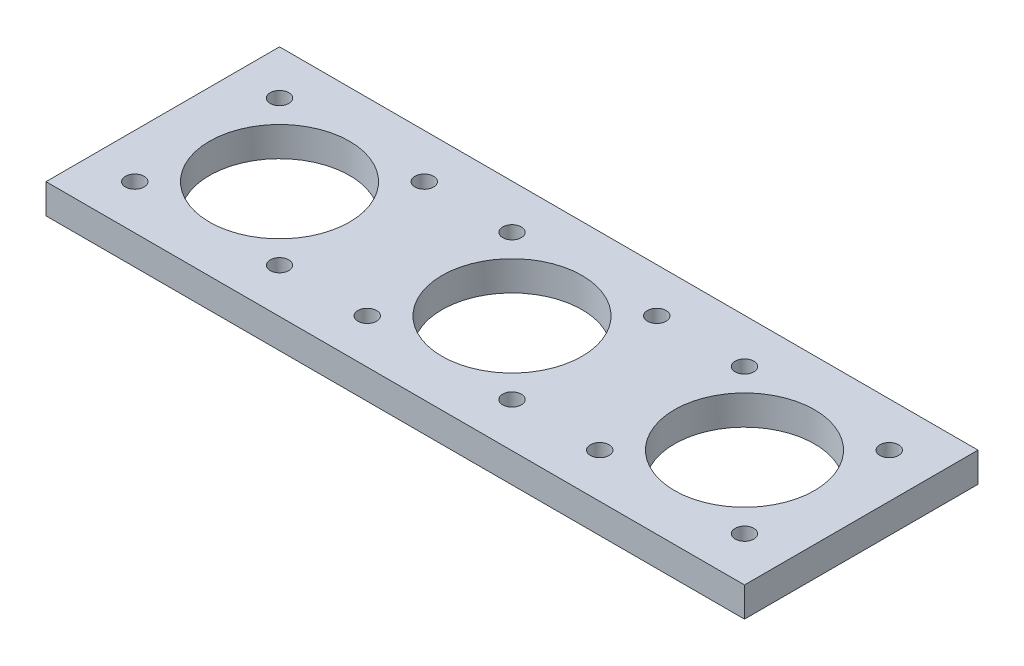
ISO-10303-21;
HEADER;
FILE_DESCRIPTION(('STEP AP214'),'2;1');
FILE_NAME('part.step','',(''),(''),'','','');
FILE_SCHEMA(('AUTOMOTIVE_DESIGN { 1 0 10303 214 1 1 1 1 }'));
ENDSEC;
DATA;
#1=APPLICATION_CONTEXT('core data for automotive mechanical design processes');
#2=APPLICATION_PROTOCOL_DEFINITION('international standard','automotive_design',2000,#1);
#3=PRODUCT_CONTEXT('',#1,'mechanical');
#4=PRODUCT('Part','Part','',(#3));
#5=PRODUCT_RELATED_PRODUCT_CATEGORY('part','',(#4));
#6=PRODUCT_DEFINITION_FORMATION('','',#4);
#7=PRODUCT_DEFINITION_CONTEXT('part definition',#1,'design');
#8=PRODUCT_DEFINITION('design','',#6,#7);
#9=PRODUCT_DEFINITION_SHAPE('','',#8);
#10=(LENGTH_UNIT() NAMED_UNIT(*) SI_UNIT(.MILLI.,.METRE.));
#11=(NAMED_UNIT(*) PLANE_ANGLE_UNIT() SI_UNIT($,.RADIAN.));
#12=(NAMED_UNIT(*) SI_UNIT($,.STERADIAN.) SOLID_ANGLE_UNIT());
#13=UNCERTAINTY_MEASURE_WITH_UNIT(LENGTH_MEASURE(1.E-05),#10,'distance_accuracy_value','');
#14=(GEOMETRIC_REPRESENTATION_CONTEXT(3) GLOBAL_UNCERTAINTY_ASSIGNED_CONTEXT((#13)) GLOBAL_UNIT_ASSIGNED_CONTEXT((#10,
#11,#12)) REPRESENTATION_CONTEXT('',''));
#15=CARTESIAN_POINT('',(0.,0.,0.));
#16=DIRECTION('',(0.,0.,1.));
#17=DIRECTION('',(1.,0.,0.));
#18=AXIS2_PLACEMENT_3D('',#15,#16,#17);
#19=CARTESIAN_POINT('',(-25.,6.35,-25.));
#20=DIRECTION('',(0.,0.,1.));
#21=DIRECTION('',(1.,0.,0.));
#22=AXIS2_PLACEMENT_3D('',#19,#20,#21);
#23=PLANE('',#22);
#24=DIRECTION('',(0.,-1.,0.));
#25=VECTOR('',#24,1.);
#26=CARTESIAN_POINT('',(-25.,6.35,-25.));
#27=LINE('',#26,#25);
#28=CARTESIAN_POINT('',(-25.,6.35,-25.));
#29=VERTEX_POINT('',#28);
#30=CARTESIAN_POINT('',(-25.,0.,-25.));
#31=VERTEX_POINT('',#30);
#32=EDGE_CURVE('E11',#29,#31,#27,.T.);
#33=ORIENTED_EDGE('',*,*,#32,.F.);
#34=DIRECTION('',(-1.,0.,0.));
#35=VECTOR('',#34,1.);
#36=CARTESIAN_POINT('',(-25.,6.35,-25.));
#37=LINE('',#36,#35);
#38=CARTESIAN_POINT('',(124.568,6.35,-25.));
#39=VERTEX_POINT('',#38);
#40=EDGE_CURVE('E89',#39,#29,#37,.T.);
#41=ORIENTED_EDGE('',*,*,#40,.F.);
#42=DIRECTION('',(0.,-1.,0.));
#43=VECTOR('',#42,1.);
#44=CARTESIAN_POINT('',(124.568,6.35,-25.));
#45=LINE('',#44,#43);
#46=CARTESIAN_POINT('',(124.568,0.,-25.));
#47=VERTEX_POINT('',#46);
#48=EDGE_CURVE('E98',#39,#47,#45,.T.);
#49=ORIENTED_EDGE('',*,*,#48,.T.);
#50=DIRECTION('',(-1.,0.,0.));
#51=VECTOR('',#50,1.);
#52=CARTESIAN_POINT('',(-25.,0.,-25.));
#53=LINE('',#52,#51);
#54=EDGE_CURVE('E64',#47,#31,#53,.T.);
#55=ORIENTED_EDGE('',*,*,#54,.T.);
#56=EDGE_LOOP('',(#33,#41,#49,#55));
#57=FACE_BOUND('',#56,.T.);
#58=ADVANCED_FACE('F37',(#57),#23,.F.);
#59=CARTESIAN_POINT('',(-25.,6.35,25.));
#60=DIRECTION('',(1.,0.,0.));
#61=DIRECTION('',(0.,0.,-1.));
#62=AXIS2_PLACEMENT_3D('',#59,#60,#61);
#63=PLANE('',#62);
#64=DIRECTION('',(0.,0.,1.));
#65=VECTOR('',#64,1.);
#66=CARTESIAN_POINT('',(-25.,0.,25.));
#67=LINE('',#66,#65);
#68=CARTESIAN_POINT('',(-25.,0.,25.));
#69=VERTEX_POINT('',#68);
#70=EDGE_CURVE('E90',#31,#69,#67,.T.);
#71=ORIENTED_EDGE('',*,*,#70,.T.);
#72=DIRECTION('',(0.,-1.,0.));
#73=VECTOR('',#72,1.);
#74=CARTESIAN_POINT('',(-25.,6.35,25.));
#75=LINE('',#74,#73);
#76=CARTESIAN_POINT('',(-25.,6.35,25.));
#77=VERTEX_POINT('',#76);
#78=EDGE_CURVE('E45',#77,#69,#75,.T.);
#79=ORIENTED_EDGE('',*,*,#78,.F.);
#80=DIRECTION('',(0.,0.,1.));
#81=VECTOR('',#80,1.);
#82=CARTESIAN_POINT('',(-25.,6.35,25.));
#83=LINE('',#82,#81);
#84=EDGE_CURVE('E53',#29,#77,#83,.T.);
#85=ORIENTED_EDGE('',*,*,#84,.F.);
#86=ORIENTED_EDGE('',*,*,#32,.T.);
#87=EDGE_LOOP('',(#71,#79,#85,#86));
#88=FACE_BOUND('',#87,.T.);
#89=ADVANCED_FACE('F175',(#88),#63,.F.);
#90=CARTESIAN_POINT('',(-25.,6.35,25.));
#91=DIRECTION('',(0.,0.,-1.));
#92=DIRECTION('',(-1.,0.,0.));
#93=AXIS2_PLACEMENT_3D('',#90,#91,#92);
#94=PLANE('',#93);
#95=DIRECTION('',(0.,-1.,0.));
#96=VECTOR('',#95,1.);
#97=CARTESIAN_POINT('',(124.568,6.35,25.));
#98=LINE('',#97,#96);
#99=CARTESIAN_POINT('',(124.568,6.35,25.));
#100=VERTEX_POINT('',#99);
#101=CARTESIAN_POINT('',(124.568,0.,25.));
#102=VERTEX_POINT('',#101);
#103=EDGE_CURVE('E84',#100,#102,#98,.T.);
#104=ORIENTED_EDGE('',*,*,#103,.F.);
#105=DIRECTION('',(1.,0.,0.));
#106=VECTOR('',#105,1.);
#107=CARTESIAN_POINT('',(-25.,6.35,25.));
#108=LINE('',#107,#106);
#109=EDGE_CURVE('E70',#77,#100,#108,.T.);
#110=ORIENTED_EDGE('',*,*,#109,.F.);
#111=ORIENTED_EDGE('',*,*,#78,.T.);
#112=DIRECTION('',(1.,0.,0.));
#113=VECTOR('',#112,1.);
#114=CARTESIAN_POINT('',(-25.,0.,25.));
#115=LINE('',#114,#113);
#116=EDGE_CURVE('E81',#69,#102,#115,.T.);
#117=ORIENTED_EDGE('',*,*,#116,.T.);
#118=EDGE_LOOP('',(#104,#110,#111,#117));
#119=FACE_BOUND('',#118,.T.);
#120=ADVANCED_FACE('F83',(#119),#94,.F.);
#121=CARTESIAN_POINT('',(0.,6.35,0.));
#122=DIRECTION('',(0.,-1.,0.));
#123=DIRECTION('',(0.,0.,-1.));
#124=AXIS2_PLACEMENT_3D('',#121,#122,#123);
#125=PLANE('',#124);
#126=ORIENTED_EDGE('',*,*,#40,.T.);
#127=ORIENTED_EDGE('',*,*,#84,.T.);
#128=ORIENTED_EDGE('',*,*,#109,.T.);
#129=DIRECTION('',(0.,0.,-1.));
#130=VECTOR('',#129,1.);
#131=CARTESIAN_POINT('',(124.568,6.35,25.));
#132=LINE('',#131,#130);
#133=EDGE_CURVE('E97',#100,#39,#132,.T.);
#134=ORIENTED_EDGE('',*,*,#133,.T.);
#135=EDGE_LOOP('',(#126,#127,#128,#134));
#136=FACE_BOUND('',#135,.T.);
#137=CARTESIAN_POINT('',(0.,6.35,0.));
#138=DIRECTION('',(0.,-1.,0.));
#139=DIRECTION('',(0.,0.,-1.));
#140=AXIS2_PLACEMENT_3D('',#137,#138,#139);
#141=CIRCLE('',#140,15.);
#142=CARTESIAN_POINT('',(0.,6.35,-15.));
#143=VERTEX_POINT('',#142);
#144=EDGE_CURVE('E167',#143,#143,#141,.T.);
#145=ORIENTED_EDGE('',*,*,#144,.T.);
#146=EDGE_LOOP('',(#145));
#147=FACE_BOUND('',#146,.T.);
#148=CARTESIAN_POINT('',(-15.5,6.35,-15.5));
#149=DIRECTION('',(0.,1.,0.));
#150=DIRECTION('',(0.,0.,1.));
#151=AXIS2_PLACEMENT_3D('',#148,#149,#150);
#152=CIRCLE('',#151,2.);
#153=CARTESIAN_POINT('',(-15.5,6.35,-13.5));
#154=VERTEX_POINT('',#153);
#155=EDGE_CURVE('E156',#154,#154,#152,.T.);
#156=ORIENTED_EDGE('',*,*,#155,.F.);
#157=EDGE_LOOP('',(#156));
#158=FACE_BOUND('',#157,.T.);
#159=CARTESIAN_POINT('',(15.5,6.35,-15.5));
#160=DIRECTION('',(0.,-1.,0.));
#161=DIRECTION('',(0.,0.,1.));
#162=AXIS2_PLACEMENT_3D('',#159,#160,#161);
#163=CIRCLE('',#162,2.);
#164=CARTESIAN_POINT('',(15.5,6.35,-13.5));
#165=VERTEX_POINT('',#164);
#166=EDGE_CURVE('E150',#165,#165,#163,.T.);
#167=ORIENTED_EDGE('',*,*,#166,.T.);
#168=EDGE_LOOP('',(#167));
#169=FACE_BOUND('',#168,.T.);
#170=CARTESIAN_POINT('',(-15.5,6.35,15.5));
#171=DIRECTION('',(0.,-1.,0.));
#172=DIRECTION('',(0.,0.,-1.));
#173=AXIS2_PLACEMENT_3D('',#170,#171,#172);
#174=CIRCLE('',#173,2.);
#175=CARTESIAN_POINT('',(-15.5,6.35,13.5));
#176=VERTEX_POINT('',#175);
#177=EDGE_CURVE('E144',#176,#176,#174,.T.);
#178=ORIENTED_EDGE('',*,*,#177,.T.);
#179=EDGE_LOOP('',(#178));
#180=FACE_BOUND('',#179,.T.);
#181=CARTESIAN_POINT('',(15.5,6.35,15.5));
#182=DIRECTION('',(0.,1.,0.));
#183=DIRECTION('',(0.,0.,-1.));
#184=AXIS2_PLACEMENT_3D('',#181,#182,#183);
#185=CIRCLE('',#184,2.);
#186=CARTESIAN_POINT('',(15.5,6.35,13.5));
#187=VERTEX_POINT('',#186);
#188=EDGE_CURVE('E140',#187,#187,#185,.T.);
#189=ORIENTED_EDGE('',*,*,#188,.F.);
#190=EDGE_LOOP('',(#189));
#191=FACE_BOUND('',#190,.T.);
#192=CARTESIAN_POINT('',(49.784,6.35,0.));
#193=DIRECTION('',(0.,-1.,0.));
#194=DIRECTION('',(0.,0.,-1.));
#195=AXIS2_PLACEMENT_3D('',#192,#193,#194);
#196=CIRCLE('',#195,15.);
#197=CARTESIAN_POINT('',(49.784,6.35,-15.));
#198=VERTEX_POINT('',#197);
#199=EDGE_CURVE('E137',#198,#198,#196,.T.);
#200=ORIENTED_EDGE('',*,*,#199,.T.);
#201=EDGE_LOOP('',(#200));
#202=FACE_BOUND('',#201,.T.);
#203=CARTESIAN_POINT('',(34.284,6.35,-15.5));
#204=DIRECTION('',(0.,1.,0.));
#205=DIRECTION('',(0.,0.,1.));
#206=AXIS2_PLACEMENT_3D('',#203,#204,#205);
#207=CIRCLE('',#206,2.);
#208=CARTESIAN_POINT('',(34.284,6.35,-13.5));
#209=VERTEX_POINT('',#208);
#210=EDGE_CURVE('E126',#209,#209,#207,.T.);
#211=ORIENTED_EDGE('',*,*,#210,.F.);
#212=EDGE_LOOP('',(#211));
#213=FACE_BOUND('',#212,.T.);
#214=CARTESIAN_POINT('',(65.284,6.35,-15.5));
#215=DIRECTION('',(0.,-1.,0.));
#216=DIRECTION('',(0.,0.,1.));
#217=AXIS2_PLACEMENT_3D('',#214,#215,#216);
#218=CIRCLE('',#217,2.);
#219=CARTESIAN_POINT('',(65.284,6.35,-13.5));
#220=VERTEX_POINT('',#219);
#221=EDGE_CURVE('E120',#220,#220,#218,.T.);
#222=ORIENTED_EDGE('',*,*,#221,.T.);
#223=EDGE_LOOP('',(#222));
#224=FACE_BOUND('',#223,.T.);
#225=CARTESIAN_POINT('',(34.284,6.35,15.5));
#226=DIRECTION('',(0.,-1.,0.));
#227=DIRECTION('',(0.,0.,-1.));
#228=AXIS2_PLACEMENT_3D('',#225,#226,#227);
#229=CIRCLE('',#228,2.);
#230=CARTESIAN_POINT('',(34.284,6.35,13.5));
#231=VERTEX_POINT('',#230);
#232=EDGE_CURVE('E114',#231,#231,#229,.T.);
#233=ORIENTED_EDGE('',*,*,#232,.T.);
#234=EDGE_LOOP('',(#233));
#235=FACE_BOUND('',#234,.T.);
#236=CARTESIAN_POINT('',(65.284,6.35,15.5));
#237=DIRECTION('',(0.,1.,0.));
#238=DIRECTION('',(0.,0.,-1.));
#239=AXIS2_PLACEMENT_3D('',#236,#237,#238);
#240=CIRCLE('',#239,2.);
#241=CARTESIAN_POINT('',(65.284,6.35,13.5));
#242=VERTEX_POINT('',#241);
#243=EDGE_CURVE('E110',#242,#242,#240,.T.);
#244=ORIENTED_EDGE('',*,*,#243,.F.);
#245=EDGE_LOOP('',(#244));
#246=FACE_BOUND('',#245,.T.);
#247=CARTESIAN_POINT('',(115.068,6.35,15.5));
#248=DIRECTION('',(0.,1.,0.));
#249=DIRECTION('',(0.,0.,-1.));
#250=AXIS2_PLACEMENT_3D('',#247,#248,#249);
#251=CIRCLE('',#250,2.);
#252=CARTESIAN_POINT('',(115.068,6.35,13.5));
#253=VERTEX_POINT('',#252);
#254=EDGE_CURVE('E203',#253,#253,#251,.T.);
#255=ORIENTED_EDGE('',*,*,#254,.F.);
#256=EDGE_LOOP('',(#255));
#257=FACE_BOUND('',#256,.T.);
#258=CARTESIAN_POINT('',(84.068,6.35,15.5));
#259=DIRECTION('',(0.,-1.,0.));
#260=DIRECTION('',(0.,0.,-1.));
#261=AXIS2_PLACEMENT_3D('',#258,#259,#260);
#262=CIRCLE('',#261,2.);
#263=CARTESIAN_POINT('',(84.068,6.35,13.5));
#264=VERTEX_POINT('',#263);
#265=EDGE_CURVE('E207',#264,#264,#262,.T.);
#266=ORIENTED_EDGE('',*,*,#265,.T.);
#267=EDGE_LOOP('',(#266));
#268=FACE_BOUND('',#267,.T.);
#269=CARTESIAN_POINT('',(115.068,6.35,-15.5));
#270=DIRECTION('',(0.,-1.,0.));
#271=DIRECTION('',(0.,0.,1.));
#272=AXIS2_PLACEMENT_3D('',#269,#270,#271);
#273=CIRCLE('',#272,2.);
#274=CARTESIAN_POINT('',(115.068,6.35,-13.5));
#275=VERTEX_POINT('',#274);
#276=EDGE_CURVE('E211',#275,#275,#273,.T.);
#277=ORIENTED_EDGE('',*,*,#276,.T.);
#278=EDGE_LOOP('',(#277));
#279=FACE_BOUND('',#278,.T.);
#280=CARTESIAN_POINT('',(84.068,6.35,-15.5));
#281=DIRECTION('',(0.,1.,0.));
#282=DIRECTION('',(0.,0.,1.));
#283=AXIS2_PLACEMENT_3D('',#280,#281,#282);
#284=CIRCLE('',#283,2.);
#285=CARTESIAN_POINT('',(84.068,6.35,-13.5));
#286=VERTEX_POINT('',#285);
#287=EDGE_CURVE('E215',#286,#286,#284,.T.);
#288=ORIENTED_EDGE('',*,*,#287,.F.);
#289=EDGE_LOOP('',(#288));
#290=FACE_BOUND('',#289,.T.);
#291=CARTESIAN_POINT('',(99.568,6.35,0.));
#292=DIRECTION('',(0.,-1.,0.));
#293=DIRECTION('',(0.,0.,-1.));
#294=AXIS2_PLACEMENT_3D('',#291,#292,#293);
#295=CIRCLE('',#294,15.);
#296=CARTESIAN_POINT('',(99.568,6.35,-15.));
#297=VERTEX_POINT('',#296);
#298=EDGE_CURVE('E102',#297,#297,#295,.T.);
#299=ORIENTED_EDGE('',*,*,#298,.T.);
#300=EDGE_LOOP('',(#299));
#301=FACE_BOUND('',#300,.T.);
#302=ADVANCED_FACE('F176',(#136,#147,#158,#169,#180,#191,#202,#213,#224,#235,#246,#257,#268,
#279,#290,#301),#125,.F.);
#303=CARTESIAN_POINT('',(0.,0.,0.));
#304=DIRECTION('',(0.,-1.,0.));
#305=DIRECTION('',(0.,0.,-1.));
#306=AXIS2_PLACEMENT_3D('',#303,#304,#305);
#307=PLANE('',#306);
#308=DIRECTION('',(0.,0.,-1.));
#309=VECTOR('',#308,1.);
#310=CARTESIAN_POINT('',(124.568,0.,25.));
#311=LINE('',#310,#309);
#312=EDGE_CURVE('E96',#102,#47,#311,.T.);
#313=ORIENTED_EDGE('',*,*,#312,.F.);
#314=ORIENTED_EDGE('',*,*,#116,.F.);
#315=ORIENTED_EDGE('',*,*,#70,.F.);
#316=ORIENTED_EDGE('',*,*,#54,.F.);
#317=EDGE_LOOP('',(#313,#314,#315,#316));
#318=FACE_BOUND('',#317,.T.);
#319=CARTESIAN_POINT('',(15.5,0.,15.5));
#320=DIRECTION('',(0.,1.,0.));
#321=DIRECTION('',(0.,0.,-1.));
#322=AXIS2_PLACEMENT_3D('',#319,#320,#321);
#323=CIRCLE('',#322,2.);
#324=CARTESIAN_POINT('',(15.5,0.,13.5));
#325=VERTEX_POINT('',#324);
#326=EDGE_CURVE('E141',#325,#325,#323,.T.);
#327=ORIENTED_EDGE('',*,*,#326,.T.);
#328=EDGE_LOOP('',(#327));
#329=FACE_BOUND('',#328,.T.);
#330=CARTESIAN_POINT('',(-15.5,0.,15.5));
#331=DIRECTION('',(0.,-1.,0.));
#332=DIRECTION('',(0.,0.,-1.));
#333=AXIS2_PLACEMENT_3D('',#330,#331,#332);
#334=CIRCLE('',#333,2.);
#335=CARTESIAN_POINT('',(-15.5,0.,13.5));
#336=VERTEX_POINT('',#335);
#337=EDGE_CURVE('E147',#336,#336,#334,.T.);
#338=ORIENTED_EDGE('',*,*,#337,.F.);
#339=EDGE_LOOP('',(#338));
#340=FACE_BOUND('',#339,.T.);
#341=CARTESIAN_POINT('',(15.5,0.,-15.5));
#342=DIRECTION('',(0.,-1.,0.));
#343=DIRECTION('',(0.,0.,1.));
#344=AXIS2_PLACEMENT_3D('',#341,#342,#343);
#345=CIRCLE('',#344,2.);
#346=CARTESIAN_POINT('',(15.5,0.,-13.5));
#347=VERTEX_POINT('',#346);
#348=EDGE_CURVE('E153',#347,#347,#345,.T.);
#349=ORIENTED_EDGE('',*,*,#348,.F.);
#350=EDGE_LOOP('',(#349));
#351=FACE_BOUND('',#350,.T.);
#352=CARTESIAN_POINT('',(-15.5,0.,-15.5));
#353=DIRECTION('',(0.,1.,0.));
#354=DIRECTION('',(0.,0.,1.));
#355=AXIS2_PLACEMENT_3D('',#352,#353,#354);
#356=CIRCLE('',#355,2.);
#357=CARTESIAN_POINT('',(-15.5,0.,-13.5));
#358=VERTEX_POINT('',#357);
#359=EDGE_CURVE('E159',#358,#358,#356,.T.);
#360=ORIENTED_EDGE('',*,*,#359,.T.);
#361=EDGE_LOOP('',(#360));
#362=FACE_BOUND('',#361,.T.);
#363=CARTESIAN_POINT('',(0.,0.,0.));
#364=DIRECTION('',(0.,1.,0.));
#365=DIRECTION('',(0.,0.,1.));
#366=AXIS2_PLACEMENT_3D('',#363,#364,#365);
#367=CIRCLE('',#366,15.);
#368=CARTESIAN_POINT('',(0.,0.,15.));
#369=VERTEX_POINT('',#368);
#370=EDGE_CURVE('E162',#369,#369,#367,.T.);
#371=ORIENTED_EDGE('',*,*,#370,.T.);
#372=EDGE_LOOP('',(#371));
#373=FACE_BOUND('',#372,.T.);
#374=CARTESIAN_POINT('',(65.284,0.,15.5));
#375=DIRECTION('',(0.,1.,0.));
#376=DIRECTION('',(0.,0.,-1.));
#377=AXIS2_PLACEMENT_3D('',#374,#375,#376);
#378=CIRCLE('',#377,2.);
#379=CARTESIAN_POINT('',(65.284,0.,13.5));
#380=VERTEX_POINT('',#379);
#381=EDGE_CURVE('E111',#380,#380,#378,.T.);
#382=ORIENTED_EDGE('',*,*,#381,.T.);
#383=EDGE_LOOP('',(#382));
#384=FACE_BOUND('',#383,.T.);
#385=CARTESIAN_POINT('',(34.284,0.,15.5));
#386=DIRECTION('',(0.,-1.,0.));
#387=DIRECTION('',(0.,0.,-1.));
#388=AXIS2_PLACEMENT_3D('',#385,#386,#387);
#389=CIRCLE('',#388,2.);
#390=CARTESIAN_POINT('',(34.284,0.,13.5));
#391=VERTEX_POINT('',#390);
#392=EDGE_CURVE('E117',#391,#391,#389,.T.);
#393=ORIENTED_EDGE('',*,*,#392,.F.);
#394=EDGE_LOOP('',(#393));
#395=FACE_BOUND('',#394,.T.);
#396=CARTESIAN_POINT('',(65.284,0.,-15.5));
#397=DIRECTION('',(0.,-1.,0.));
#398=DIRECTION('',(0.,0.,1.));
#399=AXIS2_PLACEMENT_3D('',#396,#397,#398);
#400=CIRCLE('',#399,2.);
#401=CARTESIAN_POINT('',(65.284,0.,-13.5));
#402=VERTEX_POINT('',#401);
#403=EDGE_CURVE('E123',#402,#402,#400,.T.);
#404=ORIENTED_EDGE('',*,*,#403,.F.);
#405=EDGE_LOOP('',(#404));
#406=FACE_BOUND('',#405,.T.);
#407=CARTESIAN_POINT('',(34.284,0.,-15.5));
#408=DIRECTION('',(0.,1.,0.));
#409=DIRECTION('',(0.,0.,1.));
#410=AXIS2_PLACEMENT_3D('',#407,#408,#409);
#411=CIRCLE('',#410,2.);
#412=CARTESIAN_POINT('',(34.284,0.,-13.5));
#413=VERTEX_POINT('',#412);
#414=EDGE_CURVE('E129',#413,#413,#411,.T.);
#415=ORIENTED_EDGE('',*,*,#414,.T.);
#416=EDGE_LOOP('',(#415));
#417=FACE_BOUND('',#416,.T.);
#418=CARTESIAN_POINT('',(49.784,0.,0.));
#419=DIRECTION('',(0.,1.,0.));
#420=DIRECTION('',(0.,0.,1.));
#421=AXIS2_PLACEMENT_3D('',#418,#419,#420);
#422=CIRCLE('',#421,15.);
#423=CARTESIAN_POINT('',(49.784,0.,15.));
#424=VERTEX_POINT('',#423);
#425=EDGE_CURVE('E132',#424,#424,#422,.T.);
#426=ORIENTED_EDGE('',*,*,#425,.T.);
#427=EDGE_LOOP('',(#426));
#428=FACE_BOUND('',#427,.T.);
#429=CARTESIAN_POINT('',(115.068,0.,15.5));
#430=DIRECTION('',(0.,1.,0.));
#431=DIRECTION('',(0.,0.,-1.));
#432=AXIS2_PLACEMENT_3D('',#429,#430,#431);
#433=CIRCLE('',#432,2.);
#434=CARTESIAN_POINT('',(115.068,0.,13.5));
#435=VERTEX_POINT('',#434);
#436=EDGE_CURVE('E299',#435,#435,#433,.T.);
#437=ORIENTED_EDGE('',*,*,#436,.T.);
#438=EDGE_LOOP('',(#437));
#439=FACE_BOUND('',#438,.T.);
#440=CARTESIAN_POINT('',(84.068,0.,15.5));
#441=DIRECTION('',(0.,-1.,0.));
#442=DIRECTION('',(0.,0.,-1.));
#443=AXIS2_PLACEMENT_3D('',#440,#441,#442);
#444=CIRCLE('',#443,2.);
#445=CARTESIAN_POINT('',(84.068,0.,13.5));
#446=VERTEX_POINT('',#445);
#447=EDGE_CURVE('E303',#446,#446,#444,.T.);
#448=ORIENTED_EDGE('',*,*,#447,.F.);
#449=EDGE_LOOP('',(#448));
#450=FACE_BOUND('',#449,.T.);
#451=CARTESIAN_POINT('',(115.068,0.,-15.5));
#452=DIRECTION('',(0.,-1.,0.));
#453=DIRECTION('',(0.,0.,1.));
#454=AXIS2_PLACEMENT_3D('',#451,#452,#453);
#455=CIRCLE('',#454,2.);
#456=CARTESIAN_POINT('',(115.068,0.,-13.5));
#457=VERTEX_POINT('',#456);
#458=EDGE_CURVE('E307',#457,#457,#455,.T.);
#459=ORIENTED_EDGE('',*,*,#458,.F.);
#460=EDGE_LOOP('',(#459));
#461=FACE_BOUND('',#460,.T.);
#462=CARTESIAN_POINT('',(84.068,0.,-15.5));
#463=DIRECTION('',(0.,1.,0.));
#464=DIRECTION('',(0.,0.,1.));
#465=AXIS2_PLACEMENT_3D('',#462,#463,#464);
#466=CIRCLE('',#465,2.);
#467=CARTESIAN_POINT('',(84.068,0.,-13.5));
#468=VERTEX_POINT('',#467);
#469=EDGE_CURVE('E311',#468,#468,#466,.T.);
#470=ORIENTED_EDGE('',*,*,#469,.T.);
#471=EDGE_LOOP('',(#470));
#472=FACE_BOUND('',#471,.T.);
#473=CARTESIAN_POINT('',(99.568,0.,0.));
#474=DIRECTION('',(0.,1.,0.));
#475=DIRECTION('',(0.,0.,1.));
#476=AXIS2_PLACEMENT_3D('',#473,#474,#475);
#477=CIRCLE('',#476,15.);
#478=CARTESIAN_POINT('',(99.568,0.,15.));
#479=VERTEX_POINT('',#478);
#480=EDGE_CURVE('E106',#479,#479,#477,.T.);
#481=ORIENTED_EDGE('',*,*,#480,.T.);
#482=EDGE_LOOP('',(#481));
#483=FACE_BOUND('',#482,.T.);
#484=ADVANCED_FACE('F100',(#318,#329,#340,#351,#362,#373,#384,#395,#406,#417,#428,#439,#450,
#461,#472,#483),#307,.T.);
#485=CARTESIAN_POINT('',(0.,0.,0.));
#486=DIRECTION('',(0.,1.,0.));
#487=DIRECTION('',(0.,0.,1.));
#488=AXIS2_PLACEMENT_3D('',#485,#486,#487);
#489=CYLINDRICAL_SURFACE('',#488,15.);
#490=ORIENTED_EDGE('',*,*,#370,.F.);
#491=EDGE_LOOP('',(#490));
#492=FACE_BOUND('',#491,.T.);
#493=ORIENTED_EDGE('',*,*,#144,.F.);
#494=EDGE_LOOP('',(#493));
#495=FACE_BOUND('',#494,.T.);
#496=ADVANCED_FACE('F243',(#492,#495),#489,.F.);
#497=CARTESIAN_POINT('',(-15.5,0.,-15.5));
#498=DIRECTION('',(0.,1.,0.));
#499=DIRECTION('',(0.,0.,1.));
#500=AXIS2_PLACEMENT_3D('',#497,#498,#499);
#501=CYLINDRICAL_SURFACE('',#500,2.);
#502=ORIENTED_EDGE('',*,*,#359,.F.);
#503=EDGE_LOOP('',(#502));
#504=FACE_BOUND('',#503,.T.);
#505=ORIENTED_EDGE('',*,*,#155,.T.);
#506=EDGE_LOOP('',(#505));
#507=FACE_BOUND('',#506,.T.);
#508=ADVANCED_FACE('F247',(#504,#507),#501,.F.);
#509=CARTESIAN_POINT('',(15.5,0.,-15.5));
#510=DIRECTION('',(0.,1.,0.));
#511=DIRECTION('',(0.,0.,1.));
#512=AXIS2_PLACEMENT_3D('',#509,#510,#511);
#513=CYLINDRICAL_SURFACE('',#512,2.);
#514=ORIENTED_EDGE('',*,*,#348,.T.);
#515=EDGE_LOOP('',(#514));
#516=FACE_BOUND('',#515,.T.);
#517=ORIENTED_EDGE('',*,*,#166,.F.);
#518=EDGE_LOOP('',(#517));
#519=FACE_BOUND('',#518,.T.);
#520=ADVANCED_FACE('F251',(#516,#519),#513,.F.);
#521=CARTESIAN_POINT('',(-15.5,0.,15.5));
#522=DIRECTION('',(0.,1.,0.));
#523=DIRECTION('',(0.,0.,1.));
#524=AXIS2_PLACEMENT_3D('',#521,#522,#523);
#525=CYLINDRICAL_SURFACE('',#524,2.);
#526=ORIENTED_EDGE('',*,*,#337,.T.);
#527=EDGE_LOOP('',(#526));
#528=FACE_BOUND('',#527,.T.);
#529=ORIENTED_EDGE('',*,*,#177,.F.);
#530=EDGE_LOOP('',(#529));
#531=FACE_BOUND('',#530,.T.);
#532=ADVANCED_FACE('F255',(#528,#531),#525,.F.);
#533=CARTESIAN_POINT('',(15.5,0.,15.5));
#534=DIRECTION('',(0.,1.,0.));
#535=DIRECTION('',(0.,0.,1.));
#536=AXIS2_PLACEMENT_3D('',#533,#534,#535);
#537=CYLINDRICAL_SURFACE('',#536,2.);
#538=ORIENTED_EDGE('',*,*,#326,.F.);
#539=EDGE_LOOP('',(#538));
#540=FACE_BOUND('',#539,.T.);
#541=ORIENTED_EDGE('',*,*,#188,.T.);
#542=EDGE_LOOP('',(#541));
#543=FACE_BOUND('',#542,.T.);
#544=ADVANCED_FACE('F259',(#540,#543),#537,.F.);
#545=CARTESIAN_POINT('',(49.784,0.,0.));
#546=DIRECTION('',(0.,1.,0.));
#547=DIRECTION('',(0.,0.,1.));
#548=AXIS2_PLACEMENT_3D('',#545,#546,#547);
#549=CYLINDRICAL_SURFACE('',#548,15.);
#550=ORIENTED_EDGE('',*,*,#425,.F.);
#551=EDGE_LOOP('',(#550));
#552=FACE_BOUND('',#551,.T.);
#553=ORIENTED_EDGE('',*,*,#199,.F.);
#554=EDGE_LOOP('',(#553));
#555=FACE_BOUND('',#554,.T.);
#556=ADVANCED_FACE('F263',(#552,#555),#549,.F.);
#557=CARTESIAN_POINT('',(34.284,0.,-15.5));
#558=DIRECTION('',(0.,1.,0.));
#559=DIRECTION('',(0.,0.,1.));
#560=AXIS2_PLACEMENT_3D('',#557,#558,#559);
#561=CYLINDRICAL_SURFACE('',#560,2.);
#562=ORIENTED_EDGE('',*,*,#414,.F.);
#563=EDGE_LOOP('',(#562));
#564=FACE_BOUND('',#563,.T.);
#565=ORIENTED_EDGE('',*,*,#210,.T.);
#566=EDGE_LOOP('',(#565));
#567=FACE_BOUND('',#566,.T.);
#568=ADVANCED_FACE('F267',(#564,#567),#561,.F.);
#569=CARTESIAN_POINT('',(65.284,0.,-15.5));
#570=DIRECTION('',(0.,1.,0.));
#571=DIRECTION('',(0.,0.,1.));
#572=AXIS2_PLACEMENT_3D('',#569,#570,#571);
#573=CYLINDRICAL_SURFACE('',#572,2.);
#574=ORIENTED_EDGE('',*,*,#403,.T.);
#575=EDGE_LOOP('',(#574));
#576=FACE_BOUND('',#575,.T.);
#577=ORIENTED_EDGE('',*,*,#221,.F.);
#578=EDGE_LOOP('',(#577));
#579=FACE_BOUND('',#578,.T.);
#580=ADVANCED_FACE('F271',(#576,#579),#573,.F.);
#581=CARTESIAN_POINT('',(34.284,0.,15.5));
#582=DIRECTION('',(0.,1.,0.));
#583=DIRECTION('',(0.,0.,1.));
#584=AXIS2_PLACEMENT_3D('',#581,#582,#583);
#585=CYLINDRICAL_SURFACE('',#584,2.);
#586=ORIENTED_EDGE('',*,*,#392,.T.);
#587=EDGE_LOOP('',(#586));
#588=FACE_BOUND('',#587,.T.);
#589=ORIENTED_EDGE('',*,*,#232,.F.);
#590=EDGE_LOOP('',(#589));
#591=FACE_BOUND('',#590,.T.);
#592=ADVANCED_FACE('F275',(#588,#591),#585,.F.);
#593=CARTESIAN_POINT('',(65.284,0.,15.5));
#594=DIRECTION('',(0.,1.,0.));
#595=DIRECTION('',(0.,0.,1.));
#596=AXIS2_PLACEMENT_3D('',#593,#594,#595);
#597=CYLINDRICAL_SURFACE('',#596,2.);
#598=ORIENTED_EDGE('',*,*,#381,.F.);
#599=EDGE_LOOP('',(#598));
#600=FACE_BOUND('',#599,.T.);
#601=ORIENTED_EDGE('',*,*,#243,.T.);
#602=EDGE_LOOP('',(#601));
#603=FACE_BOUND('',#602,.T.);
#604=ADVANCED_FACE('F230',(#600,#603),#597,.F.);
#605=CARTESIAN_POINT('',(124.568,6.35,25.));
#606=DIRECTION('',(-1.,0.,0.));
#607=DIRECTION('',(0.,0.,1.));
#608=AXIS2_PLACEMENT_3D('',#605,#606,#607);
#609=PLANE('',#608);
#610=ORIENTED_EDGE('',*,*,#312,.T.);
#611=ORIENTED_EDGE('',*,*,#48,.F.);
#612=ORIENTED_EDGE('',*,*,#133,.F.);
#613=ORIENTED_EDGE('',*,*,#103,.T.);
#614=EDGE_LOOP('',(#610,#611,#612,#613));
#615=FACE_BOUND('',#614,.T.);
#616=ADVANCED_FACE('F94',(#615),#609,.F.);
#617=CARTESIAN_POINT('',(99.568,0.,0.));
#618=DIRECTION('',(0.,1.,0.));
#619=DIRECTION('',(0.,0.,1.));
#620=AXIS2_PLACEMENT_3D('',#617,#618,#619);
#621=CYLINDRICAL_SURFACE('',#620,15.);
#622=ORIENTED_EDGE('',*,*,#480,.F.);
#623=EDGE_LOOP('',(#622));
#624=FACE_BOUND('',#623,.T.);
#625=ORIENTED_EDGE('',*,*,#298,.F.);
#626=EDGE_LOOP('',(#625));
#627=FACE_BOUND('',#626,.T.);
#628=ADVANCED_FACE('F218',(#624,#627),#621,.F.);
#629=CARTESIAN_POINT('',(84.068,0.,-15.5));
#630=DIRECTION('',(0.,1.,0.));
#631=DIRECTION('',(0.,0.,1.));
#632=AXIS2_PLACEMENT_3D('',#629,#630,#631);
#633=CYLINDRICAL_SURFACE('',#632,2.);
#634=ORIENTED_EDGE('',*,*,#469,.F.);
#635=EDGE_LOOP('',(#634));
#636=FACE_BOUND('',#635,.T.);
#637=ORIENTED_EDGE('',*,*,#287,.T.);
#638=EDGE_LOOP('',(#637));
#639=FACE_BOUND('',#638,.T.);
#640=ADVANCED_FACE('F220',(#636,#639),#633,.F.);
#641=CARTESIAN_POINT('',(115.068,0.,-15.5));
#642=DIRECTION('',(0.,1.,0.));
#643=DIRECTION('',(0.,0.,1.));
#644=AXIS2_PLACEMENT_3D('',#641,#642,#643);
#645=CYLINDRICAL_SURFACE('',#644,2.);
#646=ORIENTED_EDGE('',*,*,#458,.T.);
#647=EDGE_LOOP('',(#646));
#648=FACE_BOUND('',#647,.T.);
#649=ORIENTED_EDGE('',*,*,#276,.F.);
#650=EDGE_LOOP('',(#649));
#651=FACE_BOUND('',#650,.T.);
#652=ADVANCED_FACE('F227',(#648,#651),#645,.F.);
#653=CARTESIAN_POINT('',(84.068,0.,15.5));
#654=DIRECTION('',(0.,1.,0.));
#655=DIRECTION('',(0.,0.,1.));
#656=AXIS2_PLACEMENT_3D('',#653,#654,#655);
#657=CYLINDRICAL_SURFACE('',#656,2.);
#658=ORIENTED_EDGE('',*,*,#447,.T.);
#659=EDGE_LOOP('',(#658));
#660=FACE_BOUND('',#659,.T.);
#661=ORIENTED_EDGE('',*,*,#265,.F.);
#662=EDGE_LOOP('',(#661));
#663=FACE_BOUND('',#662,.T.);
#664=ADVANCED_FACE('F325',(#660,#663),#657,.F.);
#665=CARTESIAN_POINT('',(115.068,0.,15.5));
#666=DIRECTION('',(0.,1.,0.));
#667=DIRECTION('',(0.,0.,1.));
#668=AXIS2_PLACEMENT_3D('',#665,#666,#667);
#669=CYLINDRICAL_SURFACE('',#668,2.);
#670=ORIENTED_EDGE('',*,*,#436,.F.);
#671=EDGE_LOOP('',(#670));
#672=FACE_BOUND('',#671,.T.);
#673=ORIENTED_EDGE('',*,*,#254,.T.);
#674=EDGE_LOOP('',(#673));
#675=FACE_BOUND('',#674,.T.);
#676=ADVANCED_FACE('F323',(#672,#675),#669,.F.);
#677=CLOSED_SHELL('',(#58,#89,#120,#302,#484,#496,#508,#520,#532,#544,#556,#568,#580,#592,#604,
#616,#628,#640,#652,#664,#676));
#678=MANIFOLD_SOLID_BREP('B2',#677);
#679=ADVANCED_BREP_SHAPE_REPRESENTATION('',(#18,#678),#14);
#680=SHAPE_DEFINITION_REPRESENTATION(#9,#679);
ENDSEC;
END-ISO-10303-21;
